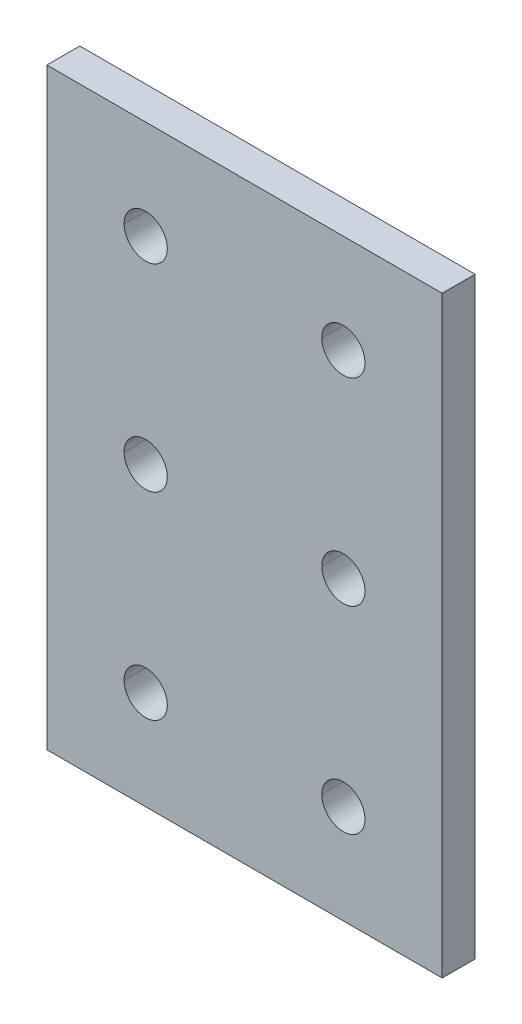
ISO-10303-21;
HEADER;
FILE_DESCRIPTION(('STEP AP214'),'2;1');
FILE_NAME('part.step','',(''),(''),'','','');
FILE_SCHEMA(('AUTOMOTIVE_DESIGN { 1 0 10303 214 1 1 1 1 }'));
ENDSEC;
DATA;
#1=APPLICATION_CONTEXT('core data for automotive mechanical design processes');
#2=APPLICATION_PROTOCOL_DEFINITION('international standard','automotive_design',2000,#1);
#3=PRODUCT_CONTEXT('',#1,'mechanical');
#4=PRODUCT('Part','Part','',(#3));
#5=PRODUCT_RELATED_PRODUCT_CATEGORY('part','',(#4));
#6=PRODUCT_DEFINITION_FORMATION('','',#4);
#7=PRODUCT_DEFINITION_CONTEXT('part definition',#1,'design');
#8=PRODUCT_DEFINITION('design','',#6,#7);
#9=PRODUCT_DEFINITION_SHAPE('','',#8);
#10=(LENGTH_UNIT() NAMED_UNIT(*) SI_UNIT(.MILLI.,.METRE.));
#11=(NAMED_UNIT(*) PLANE_ANGLE_UNIT() SI_UNIT($,.RADIAN.));
#12=(NAMED_UNIT(*) SI_UNIT($,.STERADIAN.) SOLID_ANGLE_UNIT());
#13=UNCERTAINTY_MEASURE_WITH_UNIT(LENGTH_MEASURE(1.E-05),#10,'distance_accuracy_value','');
#14=(GEOMETRIC_REPRESENTATION_CONTEXT(3) GLOBAL_UNCERTAINTY_ASSIGNED_CONTEXT((#13)) GLOBAL_UNIT_ASSIGNED_CONTEXT((#10,
#11,#12)) REPRESENTATION_CONTEXT('',''));
#15=CARTESIAN_POINT('',(0.,0.,0.));
#16=DIRECTION('',(0.,0.,1.));
#17=DIRECTION('',(1.,0.,0.));
#18=AXIS2_PLACEMENT_3D('',#15,#16,#17);
#19=CARTESIAN_POINT('',(38.1,114.3,6.35));
#20=DIRECTION('',(0.,-1.,0.));
#21=DIRECTION('',(0.,0.,-1.));
#22=AXIS2_PLACEMENT_3D('',#19,#20,#21);
#23=PLANE('',#22);
#24=DIRECTION('',(-1.,0.,0.));
#25=VECTOR('',#24,1.);
#26=CARTESIAN_POINT('',(38.1,114.3,0.));
#27=LINE('',#26,#25);
#28=CARTESIAN_POINT('',(38.1,114.3,0.));
#29=VERTEX_POINT('',#28);
#30=CARTESIAN_POINT('',(-38.1,114.3,0.));
#31=VERTEX_POINT('',#30);
#32=EDGE_CURVE('E11',#29,#31,#27,.T.);
#33=ORIENTED_EDGE('',*,*,#32,.T.);
#34=DIRECTION('',(0.,0.,-1.));
#35=VECTOR('',#34,1.);
#36=CARTESIAN_POINT('',(-38.1,114.3,6.35));
#37=LINE('',#36,#35);
#38=CARTESIAN_POINT('',(-38.1,114.3,6.35));
#39=VERTEX_POINT('',#38);
#40=EDGE_CURVE('E25',#39,#31,#37,.T.);
#41=ORIENTED_EDGE('',*,*,#40,.F.);
#42=DIRECTION('',(-1.,0.,0.));
#43=VECTOR('',#42,1.);
#44=CARTESIAN_POINT('',(38.1,114.3,6.35));
#45=LINE('',#44,#43);
#46=CARTESIAN_POINT('',(38.1,114.3,6.35));
#47=VERTEX_POINT('',#46);
#48=EDGE_CURVE('E305',#47,#39,#45,.T.);
#49=ORIENTED_EDGE('',*,*,#48,.F.);
#50=DIRECTION('',(0.,0.,-1.));
#51=VECTOR('',#50,1.);
#52=CARTESIAN_POINT('',(38.1,114.3,6.35));
#53=LINE('',#52,#51);
#54=EDGE_CURVE('E301',#47,#29,#53,.T.);
#55=ORIENTED_EDGE('',*,*,#54,.T.);
#56=EDGE_LOOP('',(#33,#41,#49,#55));
#57=FACE_BOUND('',#56,.T.);
#58=ADVANCED_FACE('F17',(#57),#23,.F.);
#59=CARTESIAN_POINT('',(38.1,0.,6.35));
#60=DIRECTION('',(-1.,0.,0.));
#61=DIRECTION('',(0.,0.,1.));
#62=AXIS2_PLACEMENT_3D('',#59,#60,#61);
#63=PLANE('',#62);
#64=DIRECTION('',(0.,1.,0.));
#65=VECTOR('',#64,1.);
#66=CARTESIAN_POINT('',(38.1,0.,0.));
#67=LINE('',#66,#65);
#68=CARTESIAN_POINT('',(38.1,0.,0.));
#69=VERTEX_POINT('',#68);
#70=EDGE_CURVE('E296',#69,#29,#67,.T.);
#71=ORIENTED_EDGE('',*,*,#70,.T.);
#72=ORIENTED_EDGE('',*,*,#54,.F.);
#73=DIRECTION('',(0.,1.,0.));
#74=VECTOR('',#73,1.);
#75=CARTESIAN_POINT('',(38.1,0.,6.35));
#76=LINE('',#75,#74);
#77=CARTESIAN_POINT('',(38.1,0.,6.35));
#78=VERTEX_POINT('',#77);
#79=EDGE_CURVE('E291',#78,#47,#76,.T.);
#80=ORIENTED_EDGE('',*,*,#79,.F.);
#81=DIRECTION('',(0.,0.,-1.));
#82=VECTOR('',#81,1.);
#83=CARTESIAN_POINT('',(38.1,0.,6.35));
#84=LINE('',#83,#82);
#85=EDGE_CURVE('E287',#78,#69,#84,.T.);
#86=ORIENTED_EDGE('',*,*,#85,.T.);
#87=EDGE_LOOP('',(#71,#72,#80,#86));
#88=FACE_BOUND('',#87,.T.);
#89=ADVANCED_FACE('F323',(#88),#63,.F.);
#90=CARTESIAN_POINT('',(-38.1,0.,6.35));
#91=DIRECTION('',(0.,1.,0.));
#92=DIRECTION('',(0.,0.,1.));
#93=AXIS2_PLACEMENT_3D('',#90,#91,#92);
#94=PLANE('',#93);
#95=DIRECTION('',(1.,0.,0.));
#96=VECTOR('',#95,1.);
#97=CARTESIAN_POINT('',(-38.1,0.,0.));
#98=LINE('',#97,#96);
#99=CARTESIAN_POINT('',(-38.1,0.,0.));
#100=VERTEX_POINT('',#99);
#101=EDGE_CURVE('E282',#100,#69,#98,.T.);
#102=ORIENTED_EDGE('',*,*,#101,.T.);
#103=ORIENTED_EDGE('',*,*,#85,.F.);
#104=DIRECTION('',(1.,0.,0.));
#105=VECTOR('',#104,1.);
#106=CARTESIAN_POINT('',(-38.1,0.,6.35));
#107=LINE('',#106,#105);
#108=CARTESIAN_POINT('',(-38.1,0.,6.35));
#109=VERTEX_POINT('',#108);
#110=EDGE_CURVE('E277',#109,#78,#107,.T.);
#111=ORIENTED_EDGE('',*,*,#110,.F.);
#112=DIRECTION('',(0.,0.,-1.));
#113=VECTOR('',#112,1.);
#114=CARTESIAN_POINT('',(-38.1,0.,6.35));
#115=LINE('',#114,#113);
#116=EDGE_CURVE('E273',#109,#100,#115,.T.);
#117=ORIENTED_EDGE('',*,*,#116,.T.);
#118=EDGE_LOOP('',(#102,#103,#111,#117));
#119=FACE_BOUND('',#118,.T.);
#120=ADVANCED_FACE('F327',(#119),#94,.F.);
#121=CARTESIAN_POINT('',(-38.1,114.3,6.35));
#122=DIRECTION('',(1.,0.,0.));
#123=DIRECTION('',(0.,0.,-1.));
#124=AXIS2_PLACEMENT_3D('',#121,#122,#123);
#125=PLANE('',#124);
#126=DIRECTION('',(0.,-1.,0.));
#127=VECTOR('',#126,1.);
#128=CARTESIAN_POINT('',(-38.1,114.3,0.));
#129=LINE('',#128,#127);
#130=EDGE_CURVE('E268',#31,#100,#129,.T.);
#131=ORIENTED_EDGE('',*,*,#130,.T.);
#132=ORIENTED_EDGE('',*,*,#116,.F.);
#133=DIRECTION('',(0.,-1.,0.));
#134=VECTOR('',#133,1.);
#135=CARTESIAN_POINT('',(-38.1,114.3,6.35));
#136=LINE('',#135,#134);
#137=EDGE_CURVE('E263',#39,#109,#136,.T.);
#138=ORIENTED_EDGE('',*,*,#137,.F.);
#139=ORIENTED_EDGE('',*,*,#40,.T.);
#140=EDGE_LOOP('',(#131,#132,#138,#139));
#141=FACE_BOUND('',#140,.T.);
#142=ADVANCED_FACE('F315',(#141),#125,.F.);
#143=CARTESIAN_POINT('',(0.,0.,6.35));
#144=DIRECTION('',(0.,0.,1.));
#145=DIRECTION('',(1.,0.,0.));
#146=AXIS2_PLACEMENT_3D('',#143,#144,#145);
#147=PLANE('',#146);
#148=CARTESIAN_POINT('',(-19.05,95.25,6.35));
#149=DIRECTION('',(0.,0.,1.));
#150=DIRECTION('',(1.,0.,0.));
#151=AXIS2_PLACEMENT_3D('',#148,#149,#150);
#152=CIRCLE('',#151,4.1656);
#153=CARTESIAN_POINT('',(-23.2156,95.25,6.35));
#154=VERTEX_POINT('',#153);
#155=CARTESIAN_POINT('',(-14.8844,95.25,6.35));
#156=VERTEX_POINT('',#155);
#157=EDGE_CURVE('E258',#154,#156,#152,.T.);
#158=ORIENTED_EDGE('',*,*,#157,.F.);
#159=CARTESIAN_POINT('',(-19.05,95.25,6.35));
#160=DIRECTION('',(0.,0.,1.));
#161=DIRECTION('',(1.,0.,0.));
#162=AXIS2_PLACEMENT_3D('',#159,#160,#161);
#163=CIRCLE('',#162,4.1656);
#164=EDGE_CURVE('E253',#156,#154,#163,.T.);
#165=ORIENTED_EDGE('',*,*,#164,.F.);
#166=EDGE_LOOP('',(#158,#165));
#167=FACE_BOUND('',#166,.T.);
#168=CARTESIAN_POINT('',(-19.05,57.15,6.35));
#169=DIRECTION('',(0.,0.,1.));
#170=DIRECTION('',(1.,0.,0.));
#171=AXIS2_PLACEMENT_3D('',#168,#169,#170);
#172=CIRCLE('',#171,4.1656);
#173=CARTESIAN_POINT('',(-23.2156,57.15,6.35));
#174=VERTEX_POINT('',#173);
#175=CARTESIAN_POINT('',(-14.8844,57.15,6.35));
#176=VERTEX_POINT('',#175);
#177=EDGE_CURVE('E248',#174,#176,#172,.T.);
#178=ORIENTED_EDGE('',*,*,#177,.F.);
#179=CARTESIAN_POINT('',(-19.05,57.15,6.35));
#180=DIRECTION('',(0.,0.,1.));
#181=DIRECTION('',(1.,0.,0.));
#182=AXIS2_PLACEMENT_3D('',#179,#180,#181);
#183=CIRCLE('',#182,4.1656);
#184=EDGE_CURVE('E243',#176,#174,#183,.T.);
#185=ORIENTED_EDGE('',*,*,#184,.F.);
#186=EDGE_LOOP('',(#178,#185));
#187=FACE_BOUND('',#186,.T.);
#188=CARTESIAN_POINT('',(-19.05,19.05,6.35));
#189=DIRECTION('',(0.,0.,1.));
#190=DIRECTION('',(1.,0.,0.));
#191=AXIS2_PLACEMENT_3D('',#188,#189,#190);
#192=CIRCLE('',#191,4.1656);
#193=CARTESIAN_POINT('',(-23.2156,19.05,6.35));
#194=VERTEX_POINT('',#193);
#195=CARTESIAN_POINT('',(-14.8844,19.05,6.35));
#196=VERTEX_POINT('',#195);
#197=EDGE_CURVE('E238',#194,#196,#192,.T.);
#198=ORIENTED_EDGE('',*,*,#197,.F.);
#199=CARTESIAN_POINT('',(-19.05,19.05,6.35));
#200=DIRECTION('',(0.,0.,1.));
#201=DIRECTION('',(1.,0.,0.));
#202=AXIS2_PLACEMENT_3D('',#199,#200,#201);
#203=CIRCLE('',#202,4.1656);
#204=EDGE_CURVE('E233',#196,#194,#203,.T.);
#205=ORIENTED_EDGE('',*,*,#204,.F.);
#206=EDGE_LOOP('',(#198,#205));
#207=FACE_BOUND('',#206,.T.);
#208=CARTESIAN_POINT('',(19.05,95.25,6.35));
#209=DIRECTION('',(0.,0.,1.));
#210=DIRECTION('',(1.,0.,0.));
#211=AXIS2_PLACEMENT_3D('',#208,#209,#210);
#212=CIRCLE('',#211,4.1656);
#213=CARTESIAN_POINT('',(14.8844,95.25,6.35));
#214=VERTEX_POINT('',#213);
#215=CARTESIAN_POINT('',(23.2156,95.25,6.35));
#216=VERTEX_POINT('',#215);
#217=EDGE_CURVE('E228',#214,#216,#212,.T.);
#218=ORIENTED_EDGE('',*,*,#217,.F.);
#219=CARTESIAN_POINT('',(19.05,95.25,6.35));
#220=DIRECTION('',(0.,0.,1.));
#221=DIRECTION('',(1.,0.,0.));
#222=AXIS2_PLACEMENT_3D('',#219,#220,#221);
#223=CIRCLE('',#222,4.1656);
#224=EDGE_CURVE('E223',#216,#214,#223,.T.);
#225=ORIENTED_EDGE('',*,*,#224,.F.);
#226=EDGE_LOOP('',(#218,#225));
#227=FACE_BOUND('',#226,.T.);
#228=CARTESIAN_POINT('',(19.05,57.15,6.35));
#229=DIRECTION('',(0.,0.,1.));
#230=DIRECTION('',(1.,0.,0.));
#231=AXIS2_PLACEMENT_3D('',#228,#229,#230);
#232=CIRCLE('',#231,4.1656);
#233=CARTESIAN_POINT('',(14.8844,57.15,6.35));
#234=VERTEX_POINT('',#233);
#235=CARTESIAN_POINT('',(23.2156,57.15,6.35));
#236=VERTEX_POINT('',#235);
#237=EDGE_CURVE('E146',#234,#236,#232,.T.);
#238=ORIENTED_EDGE('',*,*,#237,.F.);
#239=CARTESIAN_POINT('',(19.05,57.15,6.35));
#240=DIRECTION('',(0.,0.,1.));
#241=DIRECTION('',(1.,0.,0.));
#242=AXIS2_PLACEMENT_3D('',#239,#240,#241);
#243=CIRCLE('',#242,4.1656);
#244=EDGE_CURVE('E216',#236,#234,#243,.T.);
#245=ORIENTED_EDGE('',*,*,#244,.F.);
#246=EDGE_LOOP('',(#238,#245));
#247=FACE_BOUND('',#246,.T.);
#248=CARTESIAN_POINT('',(19.05,19.05,6.35));
#249=DIRECTION('',(0.,0.,1.));
#250=DIRECTION('',(1.,0.,0.));
#251=AXIS2_PLACEMENT_3D('',#248,#249,#250);
#252=CIRCLE('',#251,4.1656);
#253=CARTESIAN_POINT('',(14.8844,19.05,6.35));
#254=VERTEX_POINT('',#253);
#255=CARTESIAN_POINT('',(23.2156,19.05,6.35));
#256=VERTEX_POINT('',#255);
#257=EDGE_CURVE('E211',#254,#256,#252,.T.);
#258=ORIENTED_EDGE('',*,*,#257,.F.);
#259=CARTESIAN_POINT('',(19.05,19.05,6.35));
#260=DIRECTION('',(0.,0.,1.));
#261=DIRECTION('',(1.,0.,0.));
#262=AXIS2_PLACEMENT_3D('',#259,#260,#261);
#263=CIRCLE('',#262,4.1656);
#264=EDGE_CURVE('E206',#256,#254,#263,.T.);
#265=ORIENTED_EDGE('',*,*,#264,.F.);
#266=EDGE_LOOP('',(#258,#265));
#267=FACE_BOUND('',#266,.T.);
#268=ORIENTED_EDGE('',*,*,#48,.T.);
#269=ORIENTED_EDGE('',*,*,#137,.T.);
#270=ORIENTED_EDGE('',*,*,#110,.T.);
#271=ORIENTED_EDGE('',*,*,#79,.T.);
#272=EDGE_LOOP('',(#268,#269,#270,#271));
#273=FACE_BOUND('',#272,.T.);
#274=ADVANCED_FACE('F319',(#167,#187,#207,#227,#247,#267,#273),#147,.T.);
#275=CARTESIAN_POINT('',(19.05,19.05,6.35));
#276=DIRECTION('',(0.,0.,-1.));
#277=DIRECTION('',(0.,-1.,0.));
#278=AXIS2_PLACEMENT_3D('',#275,#276,#277);
#279=CYLINDRICAL_SURFACE('',#278,4.1656);
#280=DIRECTION('',(0.,0.,-1.));
#281=VECTOR('',#280,1.);
#282=CARTESIAN_POINT('',(23.2156,19.05,6.35));
#283=LINE('',#282,#281);
#284=CARTESIAN_POINT('',(23.2156,19.05,0.));
#285=VERTEX_POINT('',#284);
#286=EDGE_CURVE('E201',#256,#285,#283,.T.);
#287=ORIENTED_EDGE('',*,*,#286,.F.);
#288=ORIENTED_EDGE('',*,*,#264,.T.);
#289=DIRECTION('',(0.,0.,-1.));
#290=VECTOR('',#289,1.);
#291=CARTESIAN_POINT('',(14.8844,19.05,6.35));
#292=LINE('',#291,#290);
#293=CARTESIAN_POINT('',(14.8844,19.05,0.));
#294=VERTEX_POINT('',#293);
#295=EDGE_CURVE('E197',#254,#294,#292,.T.);
#296=ORIENTED_EDGE('',*,*,#295,.T.);
#297=CARTESIAN_POINT('',(19.05,19.05,0.));
#298=DIRECTION('',(0.,0.,1.));
#299=DIRECTION('',(1.,0.,0.));
#300=AXIS2_PLACEMENT_3D('',#297,#298,#299);
#301=CIRCLE('',#300,4.1656);
#302=EDGE_CURVE('E192',#285,#294,#301,.T.);
#303=ORIENTED_EDGE('',*,*,#302,.F.);
#304=EDGE_LOOP('',(#287,#288,#296,#303));
#305=FACE_BOUND('',#304,.T.);
#306=ADVANCED_FACE('F370',(#305),#279,.F.);
#307=CARTESIAN_POINT('',(0.,0.,0.));
#308=DIRECTION('',(0.,0.,1.));
#309=DIRECTION('',(1.,0.,0.));
#310=AXIS2_PLACEMENT_3D('',#307,#308,#309);
#311=PLANE('',#310);
#312=CARTESIAN_POINT('',(-19.05,95.25,0.));
#313=DIRECTION('',(0.,0.,1.));
#314=DIRECTION('',(1.,0.,0.));
#315=AXIS2_PLACEMENT_3D('',#312,#313,#314);
#316=CIRCLE('',#315,4.1656);
#317=CARTESIAN_POINT('',(-14.8844,95.25,0.));
#318=VERTEX_POINT('',#317);
#319=CARTESIAN_POINT('',(-23.2156,95.25,0.));
#320=VERTEX_POINT('',#319);
#321=EDGE_CURVE('E188',#318,#320,#316,.T.);
#322=ORIENTED_EDGE('',*,*,#321,.T.);
#323=CARTESIAN_POINT('',(-19.05,95.25,0.));
#324=DIRECTION('',(0.,0.,1.));
#325=DIRECTION('',(1.,0.,0.));
#326=AXIS2_PLACEMENT_3D('',#323,#324,#325);
#327=CIRCLE('',#326,4.1656);
#328=EDGE_CURVE('E184',#320,#318,#327,.T.);
#329=ORIENTED_EDGE('',*,*,#328,.T.);
#330=EDGE_LOOP('',(#322,#329));
#331=FACE_BOUND('',#330,.T.);
#332=CARTESIAN_POINT('',(-19.05,57.15,0.));
#333=DIRECTION('',(0.,0.,1.));
#334=DIRECTION('',(1.,0.,0.));
#335=AXIS2_PLACEMENT_3D('',#332,#333,#334);
#336=CIRCLE('',#335,4.1656);
#337=CARTESIAN_POINT('',(-14.8844,57.15,0.));
#338=VERTEX_POINT('',#337);
#339=CARTESIAN_POINT('',(-23.2156,57.15,0.));
#340=VERTEX_POINT('',#339);
#341=EDGE_CURVE('E180',#338,#340,#336,.T.);
#342=ORIENTED_EDGE('',*,*,#341,.T.);
#343=CARTESIAN_POINT('',(-19.05,57.15,0.));
#344=DIRECTION('',(0.,0.,1.));
#345=DIRECTION('',(1.,0.,0.));
#346=AXIS2_PLACEMENT_3D('',#343,#344,#345);
#347=CIRCLE('',#346,4.1656);
#348=EDGE_CURVE('E176',#340,#338,#347,.T.);
#349=ORIENTED_EDGE('',*,*,#348,.T.);
#350=EDGE_LOOP('',(#342,#349));
#351=FACE_BOUND('',#350,.T.);
#352=CARTESIAN_POINT('',(-19.05,19.05,0.));
#353=DIRECTION('',(0.,0.,1.));
#354=DIRECTION('',(1.,0.,0.));
#355=AXIS2_PLACEMENT_3D('',#352,#353,#354);
#356=CIRCLE('',#355,4.1656);
#357=CARTESIAN_POINT('',(-14.8844,19.05,0.));
#358=VERTEX_POINT('',#357);
#359=CARTESIAN_POINT('',(-23.2156,19.05,0.));
#360=VERTEX_POINT('',#359);
#361=EDGE_CURVE('E172',#358,#360,#356,.T.);
#362=ORIENTED_EDGE('',*,*,#361,.T.);
#363=CARTESIAN_POINT('',(-19.05,19.05,0.));
#364=DIRECTION('',(0.,0.,1.));
#365=DIRECTION('',(1.,0.,0.));
#366=AXIS2_PLACEMENT_3D('',#363,#364,#365);
#367=CIRCLE('',#366,4.1656);
#368=EDGE_CURVE('E168',#360,#358,#367,.T.);
#369=ORIENTED_EDGE('',*,*,#368,.T.);
#370=EDGE_LOOP('',(#362,#369));
#371=FACE_BOUND('',#370,.T.);
#372=CARTESIAN_POINT('',(19.05,95.25,0.));
#373=DIRECTION('',(0.,0.,1.));
#374=DIRECTION('',(1.,0.,0.));
#375=AXIS2_PLACEMENT_3D('',#372,#373,#374);
#376=CIRCLE('',#375,4.1656);
#377=CARTESIAN_POINT('',(23.2156,95.25,0.));
#378=VERTEX_POINT('',#377);
#379=CARTESIAN_POINT('',(14.8844,95.25,0.));
#380=VERTEX_POINT('',#379);
#381=EDGE_CURVE('E164',#378,#380,#376,.T.);
#382=ORIENTED_EDGE('',*,*,#381,.T.);
#383=CARTESIAN_POINT('',(19.05,95.25,0.));
#384=DIRECTION('',(0.,0.,1.));
#385=DIRECTION('',(1.,0.,0.));
#386=AXIS2_PLACEMENT_3D('',#383,#384,#385);
#387=CIRCLE('',#386,4.1656);
#388=EDGE_CURVE('E143',#380,#378,#387,.T.);
#389=ORIENTED_EDGE('',*,*,#388,.T.);
#390=EDGE_LOOP('',(#382,#389));
#391=FACE_BOUND('',#390,.T.);
#392=CARTESIAN_POINT('',(19.05,57.15,0.));
#393=DIRECTION('',(0.,0.,1.));
#394=DIRECTION('',(1.,0.,0.));
#395=AXIS2_PLACEMENT_3D('',#392,#393,#394);
#396=CIRCLE('',#395,4.1656);
#397=CARTESIAN_POINT('',(23.2156,57.15,0.));
#398=VERTEX_POINT('',#397);
#399=CARTESIAN_POINT('',(14.8844,57.15,0.));
#400=VERTEX_POINT('',#399);
#401=EDGE_CURVE('E129',#398,#400,#396,.T.);
#402=ORIENTED_EDGE('',*,*,#401,.T.);
#403=CARTESIAN_POINT('',(19.05,57.15,0.));
#404=DIRECTION('',(0.,0.,1.));
#405=DIRECTION('',(1.,0.,0.));
#406=AXIS2_PLACEMENT_3D('',#403,#404,#405);
#407=CIRCLE('',#406,4.1656);
#408=EDGE_CURVE('E125',#400,#398,#407,.T.);
#409=ORIENTED_EDGE('',*,*,#408,.T.);
#410=EDGE_LOOP('',(#402,#409));
#411=FACE_BOUND('',#410,.T.);
#412=ORIENTED_EDGE('',*,*,#302,.T.);
#413=CARTESIAN_POINT('',(19.05,19.05,0.));
#414=DIRECTION('',(0.,0.,1.));
#415=DIRECTION('',(1.,0.,0.));
#416=AXIS2_PLACEMENT_3D('',#413,#414,#415);
#417=CIRCLE('',#416,4.1656);
#418=EDGE_CURVE('E134',#294,#285,#417,.T.);
#419=ORIENTED_EDGE('',*,*,#418,.T.);
#420=EDGE_LOOP('',(#412,#419));
#421=FACE_BOUND('',#420,.T.);
#422=ORIENTED_EDGE('',*,*,#32,.F.);
#423=ORIENTED_EDGE('',*,*,#70,.F.);
#424=ORIENTED_EDGE('',*,*,#101,.F.);
#425=ORIENTED_EDGE('',*,*,#130,.F.);
#426=EDGE_LOOP('',(#422,#423,#424,#425));
#427=FACE_BOUND('',#426,.T.);
#428=ADVANCED_FACE('F127',(#331,#351,#371,#391,#411,#421,#427),#311,.F.);
#429=CARTESIAN_POINT('',(19.05,19.05,6.35));
#430=DIRECTION('',(0.,0.,-1.));
#431=DIRECTION('',(0.,1.,0.));
#432=AXIS2_PLACEMENT_3D('',#429,#430,#431);
#433=CYLINDRICAL_SURFACE('',#432,4.1656);
#434=ORIENTED_EDGE('',*,*,#286,.T.);
#435=ORIENTED_EDGE('',*,*,#418,.F.);
#436=ORIENTED_EDGE('',*,*,#295,.F.);
#437=ORIENTED_EDGE('',*,*,#257,.T.);
#438=EDGE_LOOP('',(#434,#435,#436,#437));
#439=FACE_BOUND('',#438,.T.);
#440=ADVANCED_FACE('F391',(#439),#433,.F.);
#441=CARTESIAN_POINT('',(19.05,57.15,6.35));
#442=DIRECTION('',(0.,0.,-1.));
#443=DIRECTION('',(0.,1.,0.));
#444=AXIS2_PLACEMENT_3D('',#441,#442,#443);
#445=CYLINDRICAL_SURFACE('',#444,4.1656);
#446=DIRECTION('',(0.,0.,-1.));
#447=VECTOR('',#446,1.);
#448=CARTESIAN_POINT('',(23.2156,57.15,6.35));
#449=LINE('',#448,#447);
#450=EDGE_CURVE('E140',#236,#398,#449,.T.);
#451=ORIENTED_EDGE('',*,*,#450,.T.);
#452=ORIENTED_EDGE('',*,*,#408,.F.);
#453=DIRECTION('',(0.,0.,-1.));
#454=VECTOR('',#453,1.);
#455=CARTESIAN_POINT('',(14.8844,57.15,6.35));
#456=LINE('',#455,#454);
#457=EDGE_CURVE('E142',#234,#400,#456,.T.);
#458=ORIENTED_EDGE('',*,*,#457,.F.);
#459=ORIENTED_EDGE('',*,*,#237,.T.);
#460=EDGE_LOOP('',(#451,#452,#458,#459));
#461=FACE_BOUND('',#460,.T.);
#462=ADVANCED_FACE('F145',(#461),#445,.F.);
#463=CARTESIAN_POINT('',(19.05,57.15,6.35));
#464=DIRECTION('',(0.,0.,-1.));
#465=DIRECTION('',(0.,-1.,0.));
#466=AXIS2_PLACEMENT_3D('',#463,#464,#465);
#467=CYLINDRICAL_SURFACE('',#466,4.1656);
#468=ORIENTED_EDGE('',*,*,#450,.F.);
#469=ORIENTED_EDGE('',*,*,#244,.T.);
#470=ORIENTED_EDGE('',*,*,#457,.T.);
#471=ORIENTED_EDGE('',*,*,#401,.F.);
#472=EDGE_LOOP('',(#468,#469,#470,#471));
#473=FACE_BOUND('',#472,.T.);
#474=ADVANCED_FACE('F138',(#473),#467,.F.);
#475=CARTESIAN_POINT('',(19.05,95.25,6.35));
#476=DIRECTION('',(0.,0.,-1.));
#477=DIRECTION('',(0.,1.,0.));
#478=AXIS2_PLACEMENT_3D('',#475,#476,#477);
#479=CYLINDRICAL_SURFACE('',#478,4.1656);
#480=DIRECTION('',(0.,0.,-1.));
#481=VECTOR('',#480,1.);
#482=CARTESIAN_POINT('',(23.2156,95.25,6.35));
#483=LINE('',#482,#481);
#484=EDGE_CURVE('E150',#216,#378,#483,.T.);
#485=ORIENTED_EDGE('',*,*,#484,.T.);
#486=ORIENTED_EDGE('',*,*,#388,.F.);
#487=DIRECTION('',(0.,0.,-1.));
#488=VECTOR('',#487,1.);
#489=CARTESIAN_POINT('',(14.8844,95.25,6.35));
#490=LINE('',#489,#488);
#491=EDGE_CURVE('E563',#214,#380,#490,.T.);
#492=ORIENTED_EDGE('',*,*,#491,.F.);
#493=ORIENTED_EDGE('',*,*,#217,.T.);
#494=EDGE_LOOP('',(#485,#486,#492,#493));
#495=FACE_BOUND('',#494,.T.);
#496=ADVANCED_FACE('F421',(#495),#479,.F.);
#497=CARTESIAN_POINT('',(19.05,95.25,6.35));
#498=DIRECTION('',(0.,0.,-1.));
#499=DIRECTION('',(0.,-1.,0.));
#500=AXIS2_PLACEMENT_3D('',#497,#498,#499);
#501=CYLINDRICAL_SURFACE('',#500,4.1656);
#502=ORIENTED_EDGE('',*,*,#484,.F.);
#503=ORIENTED_EDGE('',*,*,#224,.T.);
#504=ORIENTED_EDGE('',*,*,#491,.T.);
#505=ORIENTED_EDGE('',*,*,#381,.F.);
#506=EDGE_LOOP('',(#502,#503,#504,#505));
#507=FACE_BOUND('',#506,.T.);
#508=ADVANCED_FACE('F431',(#507),#501,.F.);
#509=CARTESIAN_POINT('',(-19.05,19.05,6.35));
#510=DIRECTION('',(0.,0.,-1.));
#511=DIRECTION('',(0.,1.,0.));
#512=AXIS2_PLACEMENT_3D('',#509,#510,#511);
#513=CYLINDRICAL_SURFACE('',#512,4.1656);
#514=DIRECTION('',(0.,0.,-1.));
#515=VECTOR('',#514,1.);
#516=CARTESIAN_POINT('',(-14.8844,19.05,6.35));
#517=LINE('',#516,#515);
#518=EDGE_CURVE('E565',#196,#358,#517,.T.);
#519=ORIENTED_EDGE('',*,*,#518,.T.);
#520=ORIENTED_EDGE('',*,*,#368,.F.);
#521=DIRECTION('',(0.,0.,-1.));
#522=VECTOR('',#521,1.);
#523=CARTESIAN_POINT('',(-23.2156,19.05,6.35));
#524=LINE('',#523,#522);
#525=EDGE_CURVE('E577',#194,#360,#524,.T.);
#526=ORIENTED_EDGE('',*,*,#525,.F.);
#527=ORIENTED_EDGE('',*,*,#197,.T.);
#528=EDGE_LOOP('',(#519,#520,#526,#527));
#529=FACE_BOUND('',#528,.T.);
#530=ADVANCED_FACE('F442',(#529),#513,.F.);
#531=CARTESIAN_POINT('',(-19.05,19.05,6.35));
#532=DIRECTION('',(0.,0.,-1.));
#533=DIRECTION('',(0.,-1.,0.));
#534=AXIS2_PLACEMENT_3D('',#531,#532,#533);
#535=CYLINDRICAL_SURFACE('',#534,4.1656);
#536=ORIENTED_EDGE('',*,*,#518,.F.);
#537=ORIENTED_EDGE('',*,*,#204,.T.);
#538=ORIENTED_EDGE('',*,*,#525,.T.);
#539=ORIENTED_EDGE('',*,*,#361,.F.);
#540=EDGE_LOOP('',(#536,#537,#538,#539));
#541=FACE_BOUND('',#540,.T.);
#542=ADVANCED_FACE('F453',(#541),#535,.F.);
#543=CARTESIAN_POINT('',(-19.05,57.15,6.35));
#544=DIRECTION('',(0.,0.,-1.));
#545=DIRECTION('',(0.,1.,0.));
#546=AXIS2_PLACEMENT_3D('',#543,#544,#545);
#547=CYLINDRICAL_SURFACE('',#546,4.1656);
#548=DIRECTION('',(0.,0.,-1.));
#549=VECTOR('',#548,1.);
#550=CARTESIAN_POINT('',(-14.8844,57.15,6.35));
#551=LINE('',#550,#549);
#552=EDGE_CURVE('E582',#176,#338,#551,.T.);
#553=ORIENTED_EDGE('',*,*,#552,.T.);
#554=ORIENTED_EDGE('',*,*,#348,.F.);
#555=DIRECTION('',(0.,0.,-1.));
#556=VECTOR('',#555,1.);
#557=CARTESIAN_POINT('',(-23.2156,57.15,6.35));
#558=LINE('',#557,#556);
#559=EDGE_CURVE('E544',#174,#340,#558,.T.);
#560=ORIENTED_EDGE('',*,*,#559,.F.);
#561=ORIENTED_EDGE('',*,*,#177,.T.);
#562=EDGE_LOOP('',(#553,#554,#560,#561));
#563=FACE_BOUND('',#562,.T.);
#564=ADVANCED_FACE('F464',(#563),#547,.F.);
#565=CARTESIAN_POINT('',(-19.05,57.15,6.35));
#566=DIRECTION('',(0.,0.,-1.));
#567=DIRECTION('',(0.,-1.,0.));
#568=AXIS2_PLACEMENT_3D('',#565,#566,#567);
#569=CYLINDRICAL_SURFACE('',#568,4.1656);
#570=ORIENTED_EDGE('',*,*,#552,.F.);
#571=ORIENTED_EDGE('',*,*,#184,.T.);
#572=ORIENTED_EDGE('',*,*,#559,.T.);
#573=ORIENTED_EDGE('',*,*,#341,.F.);
#574=EDGE_LOOP('',(#570,#571,#572,#573));
#575=FACE_BOUND('',#574,.T.);
#576=ADVANCED_FACE('F475',(#575),#569,.F.);
#577=CARTESIAN_POINT('',(-19.05,95.25,6.35));
#578=DIRECTION('',(0.,0.,-1.));
#579=DIRECTION('',(0.,1.,0.));
#580=AXIS2_PLACEMENT_3D('',#577,#578,#579);
#581=CYLINDRICAL_SURFACE('',#580,4.1656);
#582=DIRECTION('',(0.,0.,-1.));
#583=VECTOR('',#582,1.);
#584=CARTESIAN_POINT('',(-14.8844,95.25,6.35));
#585=LINE('',#584,#583);
#586=EDGE_CURVE('E541',#156,#318,#585,.T.);
#587=ORIENTED_EDGE('',*,*,#586,.T.);
#588=ORIENTED_EDGE('',*,*,#328,.F.);
#589=DIRECTION('',(0.,0.,-1.));
#590=VECTOR('',#589,1.);
#591=CARTESIAN_POINT('',(-23.2156,95.25,6.35));
#592=LINE('',#591,#590);
#593=EDGE_CURVE('E545',#154,#320,#592,.T.);
#594=ORIENTED_EDGE('',*,*,#593,.F.);
#595=ORIENTED_EDGE('',*,*,#157,.T.);
#596=EDGE_LOOP('',(#587,#588,#594,#595));
#597=FACE_BOUND('',#596,.T.);
#598=ADVANCED_FACE('F486',(#597),#581,.F.);
#599=CARTESIAN_POINT('',(-19.05,95.25,6.35));
#600=DIRECTION('',(0.,0.,-1.));
#601=DIRECTION('',(0.,-1.,0.));
#602=AXIS2_PLACEMENT_3D('',#599,#600,#601);
#603=CYLINDRICAL_SURFACE('',#602,4.1656);
#604=ORIENTED_EDGE('',*,*,#586,.F.);
#605=ORIENTED_EDGE('',*,*,#164,.T.);
#606=ORIENTED_EDGE('',*,*,#593,.T.);
#607=ORIENTED_EDGE('',*,*,#321,.F.);
#608=EDGE_LOOP('',(#604,#605,#606,#607));
#609=FACE_BOUND('',#608,.T.);
#610=ADVANCED_FACE('F497',(#609),#603,.F.);
#611=CLOSED_SHELL('',(#58,#89,#120,#142,#274,#306,#428,#440,#462,#474,#496,#508,#530,#542,#564,
#576,#598,#610));
#612=MANIFOLD_SOLID_BREP('B1',#611);
#613=ADVANCED_BREP_SHAPE_REPRESENTATION('',(#18,#612),#14);
#614=SHAPE_DEFINITION_REPRESENTATION(#9,#613);
ENDSEC;
END-ISO-10303-21;
